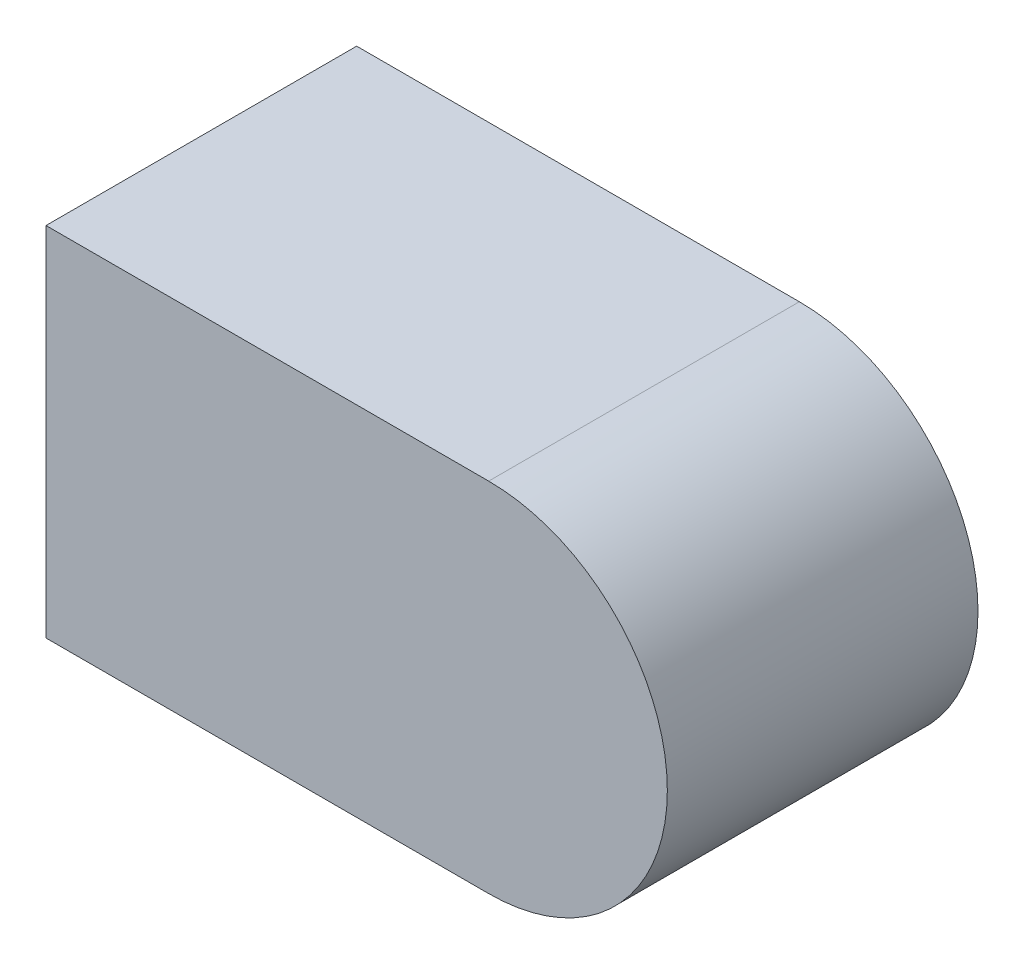
ISO-10303-21;
HEADER;
FILE_DESCRIPTION(('STEP AP214'),'2;1');
FILE_NAME('part.step','',(''),(''),'','','');
FILE_SCHEMA(('AUTOMOTIVE_DESIGN { 1 0 10303 214 1 1 1 1 }'));
ENDSEC;
DATA;
#1=APPLICATION_CONTEXT('core data for automotive mechanical design processes');
#2=APPLICATION_PROTOCOL_DEFINITION('international standard','automotive_design',2000,#1);
#3=PRODUCT_CONTEXT('',#1,'mechanical');
#4=PRODUCT('Part','Part','',(#3));
#5=PRODUCT_RELATED_PRODUCT_CATEGORY('part','',(#4));
#6=PRODUCT_DEFINITION_FORMATION('','',#4);
#7=PRODUCT_DEFINITION_CONTEXT('part definition',#1,'design');
#8=PRODUCT_DEFINITION('design','',#6,#7);
#9=PRODUCT_DEFINITION_SHAPE('','',#8);
#10=(LENGTH_UNIT() NAMED_UNIT(*) SI_UNIT(.MILLI.,.METRE.));
#11=(NAMED_UNIT(*) PLANE_ANGLE_UNIT() SI_UNIT($,.RADIAN.));
#12=(NAMED_UNIT(*) SI_UNIT($,.STERADIAN.) SOLID_ANGLE_UNIT());
#13=UNCERTAINTY_MEASURE_WITH_UNIT(LENGTH_MEASURE(1.E-05),#10,'distance_accuracy_value','');
#14=(GEOMETRIC_REPRESENTATION_CONTEXT(3) GLOBAL_UNCERTAINTY_ASSIGNED_CONTEXT((#13)) GLOBAL_UNIT_ASSIGNED_CONTEXT((#10,
#11,#12)) REPRESENTATION_CONTEXT('',''));
#15=CARTESIAN_POINT('',(0.,0.,0.));
#16=DIRECTION('',(0.,0.,1.));
#17=DIRECTION('',(1.,0.,0.));
#18=AXIS2_PLACEMENT_3D('',#15,#16,#17);
#19=CARTESIAN_POINT('',(-2.8335265642716,0.25,0.));
#20=DIRECTION('',(0.,0.,1.));
#21=DIRECTION('',(1.,0.,0.));
#22=AXIS2_PLACEMENT_3D('',#19,#20,#21);
#23=PLANE('',#22);
#24=DIRECTION('',(0.,-1.,0.));
#25=VECTOR('',#24,1.);
#26=CARTESIAN_POINT('',(-3.,0.365,0.));
#27=LINE('',#26,#25);
#28=CARTESIAN_POINT('',(-3.,0.365,0.));
#29=VERTEX_POINT('',#28);
#30=CARTESIAN_POINT('',(-3.,0.135,0.));
#31=VERTEX_POINT('',#30);
#32=EDGE_CURVE('E11',#29,#31,#27,.T.);
#33=ORIENTED_EDGE('',*,*,#32,.F.);
#34=DIRECTION('',(-1.,0.,0.));
#35=VECTOR('',#34,1.);
#36=CARTESIAN_POINT('',(-2.715,0.365,0.));
#37=LINE('',#36,#35);
#38=CARTESIAN_POINT('',(-2.715,0.365,0.));
#39=VERTEX_POINT('',#38);
#40=EDGE_CURVE('E24',#39,#29,#37,.T.);
#41=ORIENTED_EDGE('',*,*,#40,.F.);
#42=CARTESIAN_POINT('',(-2.715,0.25,0.));
#43=DIRECTION('',(0.,0.,1.));
#44=DIRECTION('',(0.,-1.,0.));
#45=AXIS2_PLACEMENT_3D('',#42,#43,#44);
#46=CIRCLE('',#45,0.115);
#47=CARTESIAN_POINT('',(-2.715,0.135,0.));
#48=VERTEX_POINT('',#47);
#49=EDGE_CURVE('E85',#48,#39,#46,.T.);
#50=ORIENTED_EDGE('',*,*,#49,.F.);
#51=DIRECTION('',(1.,0.,0.));
#52=VECTOR('',#51,1.);
#53=CARTESIAN_POINT('',(-3.,0.135,0.));
#54=LINE('',#53,#52);
#55=EDGE_CURVE('E82',#31,#48,#54,.T.);
#56=ORIENTED_EDGE('',*,*,#55,.F.);
#57=EDGE_LOOP('',(#33,#41,#50,#56));
#58=FACE_BOUND('',#57,.T.);
#59=ADVANCED_FACE('F17',(#58),#23,.F.);
#60=CARTESIAN_POINT('',(-3.,0.135,0.));
#61=DIRECTION('',(0.,-1.,0.));
#62=DIRECTION('',(1.,0.,0.));
#63=AXIS2_PLACEMENT_3D('',#60,#61,#62);
#64=PLANE('',#63);
#65=ORIENTED_EDGE('',*,*,#55,.T.);
#66=DIRECTION('',(0.,0.,1.));
#67=VECTOR('',#66,1.);
#68=CARTESIAN_POINT('',(-2.715,0.135,0.));
#69=LINE('',#68,#67);
#70=CARTESIAN_POINT('',(-2.715,0.135,0.2));
#71=VERTEX_POINT('',#70);
#72=EDGE_CURVE('E80',#48,#71,#69,.T.);
#73=ORIENTED_EDGE('',*,*,#72,.T.);
#74=DIRECTION('',(1.,0.,0.));
#75=VECTOR('',#74,1.);
#76=CARTESIAN_POINT('',(-3.,0.135,0.2));
#77=LINE('',#76,#75);
#78=CARTESIAN_POINT('',(-3.,0.135,0.2));
#79=VERTEX_POINT('',#78);
#80=EDGE_CURVE('E78',#79,#71,#77,.T.);
#81=ORIENTED_EDGE('',*,*,#80,.F.);
#82=DIRECTION('',(0.,0.,-1.));
#83=VECTOR('',#82,1.);
#84=CARTESIAN_POINT('',(-3.,0.135,0.));
#85=LINE('',#84,#83);
#86=EDGE_CURVE('E71',#79,#31,#85,.T.);
#87=ORIENTED_EDGE('',*,*,#86,.T.);
#88=EDGE_LOOP('',(#65,#73,#81,#87));
#89=FACE_BOUND('',#88,.T.);
#90=ADVANCED_FACE('F91',(#89),#64,.T.);
#91=CARTESIAN_POINT('',(-2.715,0.25,0.));
#92=DIRECTION('',(0.,0.,1.));
#93=DIRECTION('',(0.,-1.,0.));
#94=AXIS2_PLACEMENT_3D('',#91,#92,#93);
#95=CYLINDRICAL_SURFACE('',#94,0.115);
#96=ORIENTED_EDGE('',*,*,#49,.T.);
#97=DIRECTION('',(0.,0.,1.));
#98=VECTOR('',#97,1.);
#99=CARTESIAN_POINT('',(-2.715,0.365,0.));
#100=LINE('',#99,#98);
#101=CARTESIAN_POINT('',(-2.715,0.365,0.2));
#102=VERTEX_POINT('',#101);
#103=EDGE_CURVE('E75',#39,#102,#100,.T.);
#104=ORIENTED_EDGE('',*,*,#103,.T.);
#105=CARTESIAN_POINT('',(-2.715,0.25,0.2));
#106=DIRECTION('',(0.,0.,1.));
#107=DIRECTION('',(0.,-1.,0.));
#108=AXIS2_PLACEMENT_3D('',#105,#106,#107);
#109=CIRCLE('',#108,0.115);
#110=EDGE_CURVE('E59',#71,#102,#109,.T.);
#111=ORIENTED_EDGE('',*,*,#110,.F.);
#112=ORIENTED_EDGE('',*,*,#72,.F.);
#113=EDGE_LOOP('',(#96,#104,#111,#112));
#114=FACE_BOUND('',#113,.T.);
#115=ADVANCED_FACE('F89',(#114),#95,.T.);
#116=CARTESIAN_POINT('',(-2.715,0.365,0.));
#117=DIRECTION('',(0.,1.,0.));
#118=DIRECTION('',(-1.,0.,0.));
#119=AXIS2_PLACEMENT_3D('',#116,#117,#118);
#120=PLANE('',#119);
#121=ORIENTED_EDGE('',*,*,#40,.T.);
#122=DIRECTION('',(0.,0.,1.));
#123=VECTOR('',#122,1.);
#124=CARTESIAN_POINT('',(-3.,0.365,0.));
#125=LINE('',#124,#123);
#126=CARTESIAN_POINT('',(-3.,0.365,0.2));
#127=VERTEX_POINT('',#126);
#128=EDGE_CURVE('E53',#29,#127,#125,.T.);
#129=ORIENTED_EDGE('',*,*,#128,.T.);
#130=DIRECTION('',(-1.,0.,0.));
#131=VECTOR('',#130,1.);
#132=CARTESIAN_POINT('',(-2.715,0.365,0.2));
#133=LINE('',#132,#131);
#134=EDGE_CURVE('E57',#102,#127,#133,.T.);
#135=ORIENTED_EDGE('',*,*,#134,.F.);
#136=ORIENTED_EDGE('',*,*,#103,.F.);
#137=EDGE_LOOP('',(#121,#129,#135,#136));
#138=FACE_BOUND('',#137,.T.);
#139=ADVANCED_FACE('F55',(#138),#120,.T.);
#140=CARTESIAN_POINT('',(-3.,3.,0.));
#141=DIRECTION('',(-1.,0.,0.));
#142=DIRECTION('',(0.,-1.,0.));
#143=AXIS2_PLACEMENT_3D('',#140,#141,#142);
#144=PLANE('',#143);
#145=ORIENTED_EDGE('',*,*,#86,.F.);
#146=DIRECTION('',(0.,-1.,0.));
#147=VECTOR('',#146,1.);
#148=CARTESIAN_POINT('',(-3.,1.625,0.2));
#149=LINE('',#148,#147);
#150=EDGE_CURVE('E66',#127,#79,#149,.T.);
#151=ORIENTED_EDGE('',*,*,#150,.F.);
#152=ORIENTED_EDGE('',*,*,#128,.F.);
#153=ORIENTED_EDGE('',*,*,#32,.T.);
#154=EDGE_LOOP('',(#145,#151,#152,#153));
#155=FACE_BOUND('',#154,.T.);
#156=ADVANCED_FACE('F69',(#155),#144,.T.);
#157=CARTESIAN_POINT('',(-2.8335240809167,0.25,0.2));
#158=DIRECTION('',(0.,0.,1.));
#159=DIRECTION('',(1.,0.,0.));
#160=AXIS2_PLACEMENT_3D('',#157,#158,#159);
#161=PLANE('',#160);
#162=ORIENTED_EDGE('',*,*,#134,.T.);
#163=ORIENTED_EDGE('',*,*,#150,.T.);
#164=ORIENTED_EDGE('',*,*,#80,.T.);
#165=ORIENTED_EDGE('',*,*,#110,.T.);
#166=EDGE_LOOP('',(#162,#163,#164,#165));
#167=FACE_BOUND('',#166,.T.);
#168=ADVANCED_FACE('F64',(#167),#161,.T.);
#169=CLOSED_SHELL('',(#59,#90,#115,#139,#156,#168));
#170=MANIFOLD_SOLID_BREP('B1',#169);
#171=ADVANCED_BREP_SHAPE_REPRESENTATION('',(#18,#170),#14);
#172=SHAPE_DEFINITION_REPRESENTATION(#9,#171);
ENDSEC;
END-ISO-10303-21;
